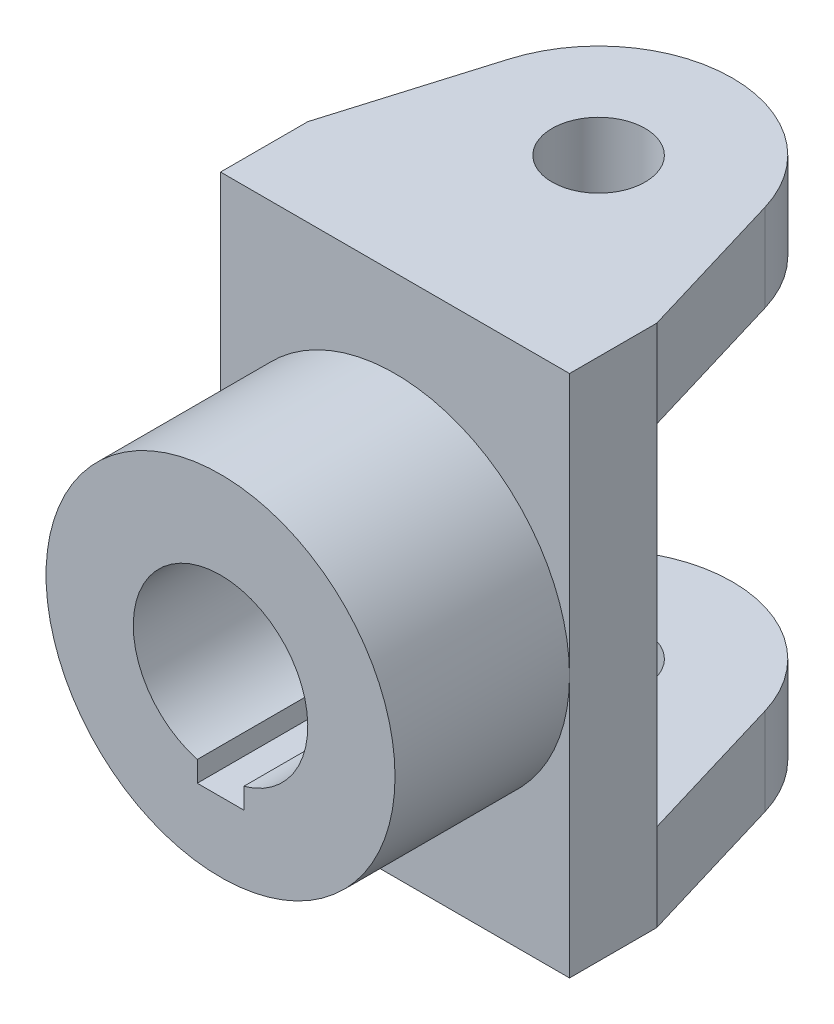
ISO-10303-21;
HEADER;
FILE_DESCRIPTION(('STEP AP214'),'2;1');
FILE_NAME('part.step','',(''),(''),'','','');
FILE_SCHEMA(('AUTOMOTIVE_DESIGN { 1 0 10303 214 1 1 1 1 }'));
ENDSEC;
DATA;
#1=APPLICATION_CONTEXT('core data for automotive mechanical design processes');
#2=APPLICATION_PROTOCOL_DEFINITION('international standard','automotive_design',2000,#1);
#3=PRODUCT_CONTEXT('',#1,'mechanical');
#4=PRODUCT('Part','Part','',(#3));
#5=PRODUCT_RELATED_PRODUCT_CATEGORY('part','',(#4));
#6=PRODUCT_DEFINITION_FORMATION('','',#4);
#7=PRODUCT_DEFINITION_CONTEXT('part definition',#1,'design');
#8=PRODUCT_DEFINITION('design','',#6,#7);
#9=PRODUCT_DEFINITION_SHAPE('','',#8);
#10=(LENGTH_UNIT() NAMED_UNIT(*) SI_UNIT(.MILLI.,.METRE.));
#11=(NAMED_UNIT(*) PLANE_ANGLE_UNIT() SI_UNIT($,.RADIAN.));
#12=(NAMED_UNIT(*) SI_UNIT($,.STERADIAN.) SOLID_ANGLE_UNIT());
#13=UNCERTAINTY_MEASURE_WITH_UNIT(LENGTH_MEASURE(1.E-05),#10,'distance_accuracy_value','');
#14=(GEOMETRIC_REPRESENTATION_CONTEXT(3) GLOBAL_UNCERTAINTY_ASSIGNED_CONTEXT((#13)) GLOBAL_UNIT_ASSIGNED_CONTEXT((#10,
#11,#12)) REPRESENTATION_CONTEXT('',''));
#15=CARTESIAN_POINT('',(0.,0.,0.));
#16=DIRECTION('',(0.,0.,1.));
#17=DIRECTION('',(1.,0.,0.));
#18=AXIS2_PLACEMENT_3D('',#15,#16,#17);
#19=CARTESIAN_POINT('',(0.,0.,-7.5));
#20=DIRECTION('',(0.,0.,1.));
#21=DIRECTION('',(1.,0.,0.));
#22=AXIS2_PLACEMENT_3D('',#19,#20,#21);
#23=PLANE('',#22);
#24=DIRECTION('',(-1.,0.,0.));
#25=VECTOR('',#24,1.);
#26=CARTESIAN_POINT('',(0.,-30.,-7.5));
#27=LINE('',#26,#25);
#28=CARTESIAN_POINT('',(30.,-30.,-7.5));
#29=VERTEX_POINT('',#28);
#30=CARTESIAN_POINT('',(-30.,-30.,-7.5));
#31=VERTEX_POINT('',#30);
#32=EDGE_CURVE('E162',#29,#31,#27,.T.);
#33=ORIENTED_EDGE('',*,*,#32,.T.);
#34=DIRECTION('',(0.,-1.,0.));
#35=VECTOR('',#34,1.);
#36=CARTESIAN_POINT('',(-30.,45.,-7.5));
#37=LINE('',#36,#35);
#38=CARTESIAN_POINT('',(-30.,30.,-7.5));
#39=VERTEX_POINT('',#38);
#40=EDGE_CURVE('E169',#39,#31,#37,.T.);
#41=ORIENTED_EDGE('',*,*,#40,.F.);
#42=DIRECTION('',(-1.,0.,0.));
#43=VECTOR('',#42,1.);
#44=CARTESIAN_POINT('',(0.,30.,-7.5));
#45=LINE('',#44,#43);
#46=CARTESIAN_POINT('',(30.,30.,-7.5));
#47=VERTEX_POINT('',#46);
#48=EDGE_CURVE('E227',#47,#39,#45,.T.);
#49=ORIENTED_EDGE('',*,*,#48,.F.);
#50=DIRECTION('',(0.,1.,0.));
#51=VECTOR('',#50,1.);
#52=CARTESIAN_POINT('',(30.,45.,-7.5));
#53=LINE('',#52,#51);
#54=EDGE_CURVE('E51',#29,#47,#53,.T.);
#55=ORIENTED_EDGE('',*,*,#54,.F.);
#56=EDGE_LOOP('',(#33,#41,#49,#55));
#57=FACE_BOUND('',#56,.T.);
#58=ADVANCED_FACE('F34',(#57),#23,.F.);
#59=CARTESIAN_POINT('',(0.,0.,7.5));
#60=DIRECTION('',(0.,0.,1.));
#61=DIRECTION('',(1.,0.,0.));
#62=AXIS2_PLACEMENT_3D('',#59,#60,#61);
#63=PLANE('',#62);
#64=CARTESIAN_POINT('',(0.,0.,7.5));
#65=DIRECTION('',(0.,0.,1.));
#66=DIRECTION('',(1.,0.,0.));
#67=AXIS2_PLACEMENT_3D('',#64,#65,#66);
#68=CIRCLE('',#67,30.);
#69=CARTESIAN_POINT('',(30.,0.,7.5));
#70=VERTEX_POINT('',#69);
#71=CARTESIAN_POINT('',(-30.,0.,7.5));
#72=VERTEX_POINT('',#71);
#73=EDGE_CURVE('E44',#70,#72,#68,.T.);
#74=ORIENTED_EDGE('',*,*,#73,.F.);
#75=DIRECTION('',(0.,1.,0.));
#76=VECTOR('',#75,1.);
#77=CARTESIAN_POINT('',(30.,45.,7.5));
#78=LINE('',#77,#76);
#79=CARTESIAN_POINT('',(30.,45.,7.5));
#80=VERTEX_POINT('',#79);
#81=EDGE_CURVE('E178',#70,#80,#78,.T.);
#82=ORIENTED_EDGE('',*,*,#81,.T.);
#83=DIRECTION('',(-1.,0.,0.));
#84=VECTOR('',#83,1.);
#85=CARTESIAN_POINT('',(-30.,45.,7.5));
#86=LINE('',#85,#84);
#87=CARTESIAN_POINT('',(-30.,45.,7.5));
#88=VERTEX_POINT('',#87);
#89=EDGE_CURVE('E201',#80,#88,#86,.T.);
#90=ORIENTED_EDGE('',*,*,#89,.T.);
#91=DIRECTION('',(0.,-1.,0.));
#92=VECTOR('',#91,1.);
#93=CARTESIAN_POINT('',(-30.,45.,7.5));
#94=LINE('',#93,#92);
#95=EDGE_CURVE('E270',#88,#72,#94,.T.);
#96=ORIENTED_EDGE('',*,*,#95,.T.);
#97=EDGE_LOOP('',(#74,#82,#90,#96));
#98=FACE_BOUND('',#97,.T.);
#99=ADVANCED_FACE('F286',(#98),#63,.T.);
#100=CARTESIAN_POINT('',(30.,45.,7.5));
#101=DIRECTION('',(-1.,0.,0.));
#102=DIRECTION('',(0.,-1.,0.));
#103=AXIS2_PLACEMENT_3D('',#100,#101,#102);
#104=PLANE('',#103);
#105=CARTESIAN_POINT('',(30.,-45.,-7.5));
#106=VERTEX_POINT('',#105);
#107=EDGE_CURVE('E176',#106,#29,#53,.T.);
#108=ORIENTED_EDGE('',*,*,#107,.T.);
#109=ORIENTED_EDGE('',*,*,#54,.T.);
#110=DIRECTION('',(0.,1.,0.));
#111=VECTOR('',#110,1.);
#112=CARTESIAN_POINT('',(30.,30.,-7.5));
#113=LINE('',#112,#111);
#114=CARTESIAN_POINT('',(30.,45.,-7.5));
#115=VERTEX_POINT('',#114);
#116=EDGE_CURVE('E207',#47,#115,#113,.T.);
#117=ORIENTED_EDGE('',*,*,#116,.T.);
#118=DIRECTION('',(0.,0.,-1.));
#119=VECTOR('',#118,1.);
#120=CARTESIAN_POINT('',(30.,45.,7.5));
#121=LINE('',#120,#119);
#122=EDGE_CURVE('E38',#80,#115,#121,.T.);
#123=ORIENTED_EDGE('',*,*,#122,.F.);
#124=ORIENTED_EDGE('',*,*,#81,.F.);
#125=CARTESIAN_POINT('',(30.,-45.,7.5));
#126=VERTEX_POINT('',#125);
#127=EDGE_CURVE('E266',#126,#70,#78,.T.);
#128=ORIENTED_EDGE('',*,*,#127,.F.);
#129=DIRECTION('',(0.,0.,-1.));
#130=VECTOR('',#129,1.);
#131=CARTESIAN_POINT('',(30.,-45.,7.5));
#132=LINE('',#131,#130);
#133=EDGE_CURVE('E182',#126,#106,#132,.T.);
#134=ORIENTED_EDGE('',*,*,#133,.T.);
#135=EDGE_LOOP('',(#108,#109,#117,#123,#124,#128,#134));
#136=FACE_BOUND('',#135,.T.);
#137=ADVANCED_FACE('F36',(#136),#104,.F.);
#138=CARTESIAN_POINT('',(-30.,45.,7.5));
#139=DIRECTION('',(0.,-1.,0.));
#140=DIRECTION('',(0.,0.,-1.));
#141=AXIS2_PLACEMENT_3D('',#138,#139,#140);
#142=PLANE('',#141);
#143=ORIENTED_EDGE('',*,*,#122,.T.);
#144=DIRECTION('',(-0.286928155856414,0.,-0.957952103905429));
#145=VECTOR('',#144,1.);
#146=CARTESIAN_POINT('',(29.5916427305978,45.,-8.86336116684442));
#147=LINE('',#146,#145);
#148=CARTESIAN_POINT('',(22.0328983898444,45.,-34.0993475846926));
#149=VERTEX_POINT('',#148);
#150=EDGE_CURVE('E200',#115,#149,#147,.T.);
#151=ORIENTED_EDGE('',*,*,#150,.T.);
#152=CARTESIAN_POINT('',(3.61065344289813E-11,45.,-27.5));
#153=DIRECTION('',(0.,1.,0.));
#154=DIRECTION('',(0.,0.,1.));
#155=AXIS2_PLACEMENT_3D('',#152,#153,#154);
#156=CIRCLE('',#155,22.9999999999655);
#157=CARTESIAN_POINT('',(-22.0328983897558,45.,-34.0993475847475));
#158=VERTEX_POINT('',#157);
#159=EDGE_CURVE('E211',#149,#158,#156,.T.);
#160=ORIENTED_EDGE('',*,*,#159,.T.);
#161=DIRECTION('',(0.2869281558588,0.,-0.957952103904714));
#162=VECTOR('',#161,1.);
#163=CARTESIAN_POINT('',(-29.5916427305723,45.,-8.86336116691711));
#164=LINE('',#163,#162);
#165=CARTESIAN_POINT('',(-30.,45.,-7.5));
#166=VERTEX_POINT('',#165);
#167=EDGE_CURVE('E214',#166,#158,#164,.T.);
#168=ORIENTED_EDGE('',*,*,#167,.F.);
#169=DIRECTION('',(0.,0.,-1.));
#170=VECTOR('',#169,1.);
#171=CARTESIAN_POINT('',(-30.,45.,7.5));
#172=LINE('',#171,#170);
#173=EDGE_CURVE('E187',#88,#166,#172,.T.);
#174=ORIENTED_EDGE('',*,*,#173,.F.);
#175=ORIENTED_EDGE('',*,*,#89,.F.);
#176=EDGE_LOOP('',(#143,#151,#160,#168,#174,#175));
#177=FACE_BOUND('',#176,.T.);
#178=CARTESIAN_POINT('',(3.61065344289813E-11,45.,-27.5));
#179=DIRECTION('',(0.,1.,0.));
#180=DIRECTION('',(0.,0.,1.));
#181=AXIS2_PLACEMENT_3D('',#178,#179,#180);
#182=CIRCLE('',#181,7.99999999996547);
#183=CARTESIAN_POINT('',(3.61065344289813E-11,45.,-19.5000000000345));
#184=VERTEX_POINT('',#183);
#185=EDGE_CURVE('E224',#184,#184,#182,.T.);
#186=ORIENTED_EDGE('',*,*,#185,.F.);
#187=EDGE_LOOP('',(#186));
#188=FACE_BOUND('',#187,.T.);
#189=ADVANCED_FACE('F197',(#177,#188),#142,.F.);
#190=CARTESIAN_POINT('',(-30.,45.,7.5));
#191=DIRECTION('',(1.,0.,0.));
#192=DIRECTION('',(0.,1.,0.));
#193=AXIS2_PLACEMENT_3D('',#190,#191,#192);
#194=PLANE('',#193);
#195=EDGE_CURVE('E175',#166,#39,#37,.T.);
#196=ORIENTED_EDGE('',*,*,#195,.T.);
#197=ORIENTED_EDGE('',*,*,#40,.T.);
#198=DIRECTION('',(0.,-1.,0.));
#199=VECTOR('',#198,1.);
#200=CARTESIAN_POINT('',(-30.,-30.,-7.5));
#201=LINE('',#200,#199);
#202=CARTESIAN_POINT('',(-30.,-45.,-7.5));
#203=VERTEX_POINT('',#202);
#204=EDGE_CURVE('E144',#31,#203,#201,.T.);
#205=ORIENTED_EDGE('',*,*,#204,.T.);
#206=DIRECTION('',(0.,0.,-1.));
#207=VECTOR('',#206,1.);
#208=CARTESIAN_POINT('',(-30.,-45.,7.5));
#209=LINE('',#208,#207);
#210=CARTESIAN_POINT('',(-30.,-45.,7.5));
#211=VERTEX_POINT('',#210);
#212=EDGE_CURVE('E185',#211,#203,#209,.T.);
#213=ORIENTED_EDGE('',*,*,#212,.F.);
#214=EDGE_CURVE('E269',#72,#211,#94,.T.);
#215=ORIENTED_EDGE('',*,*,#214,.F.);
#216=ORIENTED_EDGE('',*,*,#95,.F.);
#217=ORIENTED_EDGE('',*,*,#173,.T.);
#218=EDGE_LOOP('',(#196,#197,#205,#213,#215,#216,#217));
#219=FACE_BOUND('',#218,.T.);
#220=ADVANCED_FACE('F173',(#219),#194,.F.);
#221=CARTESIAN_POINT('',(-30.,-45.,7.5));
#222=DIRECTION('',(0.,1.,0.));
#223=DIRECTION('',(0.,0.,1.));
#224=AXIS2_PLACEMENT_3D('',#221,#222,#223);
#225=PLANE('',#224);
#226=ORIENTED_EDGE('',*,*,#212,.T.);
#227=DIRECTION('',(0.2869281558588,0.,-0.957952103904714));
#228=VECTOR('',#227,1.);
#229=CARTESIAN_POINT('',(-29.5916427305723,-45.,-8.86336116691711));
#230=LINE('',#229,#228);
#231=CARTESIAN_POINT('',(-22.0328983897558,-45.,-34.0993475847475));
#232=VERTEX_POINT('',#231);
#233=EDGE_CURVE('E149',#203,#232,#230,.T.);
#234=ORIENTED_EDGE('',*,*,#233,.T.);
#235=CARTESIAN_POINT('',(3.61065344289813E-11,-45.,-27.5));
#236=DIRECTION('',(0.,1.,0.));
#237=DIRECTION('',(0.,0.,1.));
#238=AXIS2_PLACEMENT_3D('',#235,#236,#237);
#239=CIRCLE('',#238,22.9999999999655);
#240=CARTESIAN_POINT('',(22.0328983898444,-45.,-34.0993475846926));
#241=VERTEX_POINT('',#240);
#242=EDGE_CURVE('E290',#241,#232,#239,.T.);
#243=ORIENTED_EDGE('',*,*,#242,.F.);
#244=DIRECTION('',(-0.286928155856414,0.,-0.957952103905429));
#245=VECTOR('',#244,1.);
#246=CARTESIAN_POINT('',(29.5916427305978,-45.,-8.86336116684442));
#247=LINE('',#246,#245);
#248=EDGE_CURVE('E282',#106,#241,#247,.T.);
#249=ORIENTED_EDGE('',*,*,#248,.F.);
#250=ORIENTED_EDGE('',*,*,#133,.F.);
#251=DIRECTION('',(1.,0.,0.));
#252=VECTOR('',#251,1.);
#253=CARTESIAN_POINT('',(-30.,-45.,7.5));
#254=LINE('',#253,#252);
#255=EDGE_CURVE('E186',#211,#126,#254,.T.);
#256=ORIENTED_EDGE('',*,*,#255,.F.);
#257=EDGE_LOOP('',(#226,#234,#243,#249,#250,#256));
#258=FACE_BOUND('',#257,.T.);
#259=CARTESIAN_POINT('',(3.61065344289813E-11,-45.,-27.5));
#260=DIRECTION('',(0.,1.,0.));
#261=DIRECTION('',(0.,0.,1.));
#262=AXIS2_PLACEMENT_3D('',#259,#260,#261);
#263=CIRCLE('',#262,7.99999999996547);
#264=CARTESIAN_POINT('',(3.61065344289813E-11,-45.,-19.5000000000345));
#265=VERTEX_POINT('',#264);
#266=EDGE_CURVE('E171',#265,#265,#263,.T.);
#267=ORIENTED_EDGE('',*,*,#266,.T.);
#268=EDGE_LOOP('',(#267));
#269=FACE_BOUND('',#268,.T.);
#270=ADVANCED_FACE('F279',(#258,#269),#225,.F.);
#271=EDGE_CURVE('E11',#72,#70,#68,.T.);
#272=ORIENTED_EDGE('',*,*,#271,.F.);
#273=ORIENTED_EDGE('',*,*,#214,.T.);
#274=ORIENTED_EDGE('',*,*,#255,.T.);
#275=ORIENTED_EDGE('',*,*,#127,.T.);
#276=EDGE_LOOP('',(#272,#273,#274,#275));
#277=FACE_BOUND('',#276,.T.);
#278=ADVANCED_FACE('F275',(#277),#63,.T.);
#279=CARTESIAN_POINT('',(0.,0.,37.5));
#280=DIRECTION('',(0.,0.,-1.));
#281=DIRECTION('',(-1.,0.,0.));
#282=AXIS2_PLACEMENT_3D('',#279,#280,#281);
#283=CYLINDRICAL_SURFACE('',#282,15.);
#284=CARTESIAN_POINT('',(0.,0.,7.5));
#285=DIRECTION('',(0.,0.,1.));
#286=DIRECTION('',(1.,0.,0.));
#287=AXIS2_PLACEMENT_3D('',#284,#285,#286);
#288=CIRCLE('',#287,15.);
#289=CARTESIAN_POINT('',(4.,-14.456832294801,7.5));
#290=VERTEX_POINT('',#289);
#291=CARTESIAN_POINT('',(-4.,-14.456832294801,7.5));
#292=VERTEX_POINT('',#291);
#293=EDGE_CURVE('E59',#290,#292,#288,.T.);
#294=ORIENTED_EDGE('',*,*,#293,.F.);
#295=DIRECTION('',(0.,0.,-1.));
#296=VECTOR('',#295,1.);
#297=CARTESIAN_POINT('',(4.,-14.456832294801,37.5));
#298=LINE('',#297,#296);
#299=CARTESIAN_POINT('',(4.,-14.456832294801,37.5));
#300=VERTEX_POINT('',#299);
#301=EDGE_CURVE('E263',#300,#290,#298,.T.);
#302=ORIENTED_EDGE('',*,*,#301,.F.);
#303=CARTESIAN_POINT('',(0.,0.,37.5));
#304=DIRECTION('',(0.,0.,1.));
#305=DIRECTION('',(1.,0.,0.));
#306=AXIS2_PLACEMENT_3D('',#303,#304,#305);
#307=CIRCLE('',#306,15.);
#308=CARTESIAN_POINT('',(-4.,-14.456832294801,37.5));
#309=VERTEX_POINT('',#308);
#310=EDGE_CURVE('E232',#300,#309,#307,.T.);
#311=ORIENTED_EDGE('',*,*,#310,.T.);
#312=DIRECTION('',(0.,0.,-1.));
#313=VECTOR('',#312,1.);
#314=CARTESIAN_POINT('',(-4.,-14.456832294801,37.5));
#315=LINE('',#314,#313);
#316=EDGE_CURVE('E246',#309,#292,#315,.T.);
#317=ORIENTED_EDGE('',*,*,#316,.T.);
#318=EDGE_LOOP('',(#294,#302,#311,#317));
#319=FACE_BOUND('',#318,.T.);
#320=ADVANCED_FACE('F339',(#319),#283,.F.);
#321=CARTESIAN_POINT('',(4.,0.,37.5));
#322=DIRECTION('',(1.,0.,0.));
#323=DIRECTION('',(0.,0.,-1.));
#324=AXIS2_PLACEMENT_3D('',#321,#322,#323);
#325=PLANE('',#324);
#326=DIRECTION('',(0.,-1.,0.));
#327=VECTOR('',#326,1.);
#328=CARTESIAN_POINT('',(4.,0.,7.5));
#329=LINE('',#328,#327);
#330=CARTESIAN_POINT('',(4.,-18.,7.5));
#331=VERTEX_POINT('',#330);
#332=EDGE_CURVE('E248',#290,#331,#329,.T.);
#333=ORIENTED_EDGE('',*,*,#332,.T.);
#334=DIRECTION('',(0.,0.,-1.));
#335=VECTOR('',#334,1.);
#336=CARTESIAN_POINT('',(4.,-18.,37.5));
#337=LINE('',#336,#335);
#338=CARTESIAN_POINT('',(4.,-18.,37.5));
#339=VERTEX_POINT('',#338);
#340=EDGE_CURVE('E260',#339,#331,#337,.T.);
#341=ORIENTED_EDGE('',*,*,#340,.F.);
#342=DIRECTION('',(0.,-1.,0.));
#343=VECTOR('',#342,1.);
#344=CARTESIAN_POINT('',(4.,0.,37.5));
#345=LINE('',#344,#343);
#346=EDGE_CURVE('E235',#300,#339,#345,.T.);
#347=ORIENTED_EDGE('',*,*,#346,.F.);
#348=ORIENTED_EDGE('',*,*,#301,.T.);
#349=EDGE_LOOP('',(#333,#341,#347,#348));
#350=FACE_BOUND('',#349,.T.);
#351=ADVANCED_FACE('F343',(#350),#325,.F.);
#352=CARTESIAN_POINT('',(0.,-18.,37.5));
#353=DIRECTION('',(0.,1.,0.));
#354=DIRECTION('',(0.,0.,1.));
#355=AXIS2_PLACEMENT_3D('',#352,#353,#354);
#356=PLANE('',#355);
#357=DIRECTION('',(1.,0.,0.));
#358=VECTOR('',#357,1.);
#359=CARTESIAN_POINT('',(0.,-18.,7.5));
#360=LINE('',#359,#358);
#361=CARTESIAN_POINT('',(-4.,-18.,7.5));
#362=VERTEX_POINT('',#361);
#363=EDGE_CURVE('E251',#362,#331,#360,.T.);
#364=ORIENTED_EDGE('',*,*,#363,.F.);
#365=DIRECTION('',(0.,0.,-1.));
#366=VECTOR('',#365,1.);
#367=CARTESIAN_POINT('',(-4.,-18.,37.5));
#368=LINE('',#367,#366);
#369=CARTESIAN_POINT('',(-4.,-18.,37.5));
#370=VERTEX_POINT('',#369);
#371=EDGE_CURVE('E257',#370,#362,#368,.T.);
#372=ORIENTED_EDGE('',*,*,#371,.F.);
#373=DIRECTION('',(1.,0.,0.));
#374=VECTOR('',#373,1.);
#375=CARTESIAN_POINT('',(0.,-18.,37.5));
#376=LINE('',#375,#374);
#377=EDGE_CURVE('E237',#370,#339,#376,.T.);
#378=ORIENTED_EDGE('',*,*,#377,.T.);
#379=ORIENTED_EDGE('',*,*,#340,.T.);
#380=EDGE_LOOP('',(#364,#372,#378,#379));
#381=FACE_BOUND('',#380,.T.);
#382=ADVANCED_FACE('F368',(#381),#356,.T.);
#383=CARTESIAN_POINT('',(-4.,0.,37.5));
#384=DIRECTION('',(1.,0.,0.));
#385=DIRECTION('',(0.,0.,-1.));
#386=AXIS2_PLACEMENT_3D('',#383,#384,#385);
#387=PLANE('',#386);
#388=DIRECTION('',(0.,-1.,0.));
#389=VECTOR('',#388,1.);
#390=CARTESIAN_POINT('',(-4.,0.,7.5));
#391=LINE('',#390,#389);
#392=EDGE_CURVE('E253',#292,#362,#391,.T.);
#393=ORIENTED_EDGE('',*,*,#392,.F.);
#394=ORIENTED_EDGE('',*,*,#316,.F.);
#395=DIRECTION('',(0.,-1.,0.));
#396=VECTOR('',#395,1.);
#397=CARTESIAN_POINT('',(-4.,0.,37.5));
#398=LINE('',#397,#396);
#399=EDGE_CURVE('E240',#309,#370,#398,.T.);
#400=ORIENTED_EDGE('',*,*,#399,.T.);
#401=ORIENTED_EDGE('',*,*,#371,.T.);
#402=EDGE_LOOP('',(#393,#394,#400,#401));
#403=FACE_BOUND('',#402,.T.);
#404=ADVANCED_FACE('F365',(#403),#387,.T.);
#405=CARTESIAN_POINT('',(0.,0.,37.5));
#406=DIRECTION('',(0.,0.,-1.));
#407=DIRECTION('',(-1.,0.,0.));
#408=AXIS2_PLACEMENT_3D('',#405,#406,#407);
#409=CYLINDRICAL_SURFACE('',#408,30.);
#410=CARTESIAN_POINT('',(0.,0.,37.5));
#411=DIRECTION('',(0.,0.,1.));
#412=DIRECTION('',(1.,0.,0.));
#413=AXIS2_PLACEMENT_3D('',#410,#411,#412);
#414=CIRCLE('',#413,30.);
#415=CARTESIAN_POINT('',(30.,0.,37.5));
#416=VERTEX_POINT('',#415);
#417=EDGE_CURVE('E243',#416,#416,#414,.T.);
#418=ORIENTED_EDGE('',*,*,#417,.F.);
#419=EDGE_LOOP('',(#418));
#420=FACE_BOUND('',#419,.T.);
#421=ORIENTED_EDGE('',*,*,#73,.T.);
#422=ORIENTED_EDGE('',*,*,#271,.T.);
#423=EDGE_LOOP('',(#421,#422));
#424=FACE_BOUND('',#423,.T.);
#425=ADVANCED_FACE('F288',(#420,#424),#409,.T.);
#426=CARTESIAN_POINT('',(0.,0.,37.5));
#427=DIRECTION('',(0.,0.,1.));
#428=DIRECTION('',(1.,0.,0.));
#429=AXIS2_PLACEMENT_3D('',#426,#427,#428);
#430=PLANE('',#429);
#431=ORIENTED_EDGE('',*,*,#310,.F.);
#432=ORIENTED_EDGE('',*,*,#346,.T.);
#433=ORIENTED_EDGE('',*,*,#377,.F.);
#434=ORIENTED_EDGE('',*,*,#399,.F.);
#435=EDGE_LOOP('',(#431,#432,#433,#434));
#436=FACE_BOUND('',#435,.T.);
#437=ORIENTED_EDGE('',*,*,#417,.T.);
#438=EDGE_LOOP('',(#437));
#439=FACE_BOUND('',#438,.T.);
#440=ADVANCED_FACE('F347',(#436,#439),#430,.T.);
#441=ORIENTED_EDGE('',*,*,#332,.F.);
#442=ORIENTED_EDGE('',*,*,#293,.T.);
#443=ORIENTED_EDGE('',*,*,#392,.T.);
#444=ORIENTED_EDGE('',*,*,#363,.T.);
#445=EDGE_LOOP('',(#441,#442,#443,#444));
#446=FACE_BOUND('',#445,.T.);
#447=ADVANCED_FACE('F332',(#446),#63,.T.);
#448=CARTESIAN_POINT('',(-29.5916427305723,30.,-8.86336116691711));
#449=DIRECTION('',(0.957952103904714,0.,0.2869281558588));
#450=DIRECTION('',(0.2869281558588,0.,-0.957952103904714));
#451=AXIS2_PLACEMENT_3D('',#448,#449,#450);
#452=PLANE('',#451);
#453=ORIENTED_EDGE('',*,*,#167,.T.);
#454=DIRECTION('',(0.,1.,0.));
#455=VECTOR('',#454,1.);
#456=CARTESIAN_POINT('',(-22.0328983897558,30.,-34.0993475847475));
#457=LINE('',#456,#455);
#458=CARTESIAN_POINT('',(-22.0328983897558,30.,-34.0993475847475));
#459=VERTEX_POINT('',#458);
#460=EDGE_CURVE('E228',#459,#158,#457,.T.);
#461=ORIENTED_EDGE('',*,*,#460,.F.);
#462=DIRECTION('',(0.2869281558588,0.,-0.957952103904714));
#463=VECTOR('',#462,1.);
#464=CARTESIAN_POINT('',(-29.5916427305723,30.,-8.86336116691711));
#465=LINE('',#464,#463);
#466=EDGE_CURVE('E306',#39,#459,#465,.T.);
#467=ORIENTED_EDGE('',*,*,#466,.F.);
#468=ORIENTED_EDGE('',*,*,#195,.F.);
#469=EDGE_LOOP('',(#453,#461,#467,#468));
#470=FACE_BOUND('',#469,.T.);
#471=ADVANCED_FACE('F346',(#470),#452,.F.);
#472=CARTESIAN_POINT('',(3.61065344289813E-11,30.,-27.5));
#473=DIRECTION('',(0.,1.,0.));
#474=DIRECTION('',(0.,0.,1.));
#475=AXIS2_PLACEMENT_3D('',#472,#473,#474);
#476=CYLINDRICAL_SURFACE('',#475,22.9999999999655);
#477=ORIENTED_EDGE('',*,*,#159,.F.);
#478=DIRECTION('',(0.,1.,0.));
#479=VECTOR('',#478,1.);
#480=CARTESIAN_POINT('',(22.0328983898444,30.,-34.0993475846926));
#481=LINE('',#480,#479);
#482=CARTESIAN_POINT('',(22.0328983898444,30.,-34.0993475846926));
#483=VERTEX_POINT('',#482);
#484=EDGE_CURVE('E209',#483,#149,#481,.T.);
#485=ORIENTED_EDGE('',*,*,#484,.F.);
#486=CARTESIAN_POINT('',(3.61065344289813E-11,30.,-27.5));
#487=DIRECTION('',(0.,1.,0.));
#488=DIRECTION('',(0.,0.,1.));
#489=AXIS2_PLACEMENT_3D('',#486,#487,#488);
#490=CIRCLE('',#489,22.9999999999655);
#491=EDGE_CURVE('E304',#483,#459,#490,.T.);
#492=ORIENTED_EDGE('',*,*,#491,.T.);
#493=ORIENTED_EDGE('',*,*,#460,.T.);
#494=EDGE_LOOP('',(#477,#485,#492,#493));
#495=FACE_BOUND('',#494,.T.);
#496=ADVANCED_FACE('F352',(#495),#476,.T.);
#497=CARTESIAN_POINT('',(29.5916427305978,30.,-8.86336116684442));
#498=DIRECTION('',(0.957952103905429,0.,-0.286928155856414));
#499=DIRECTION('',(-0.286928155856414,0.,-0.957952103905429));
#500=AXIS2_PLACEMENT_3D('',#497,#498,#499);
#501=PLANE('',#500);
#502=ORIENTED_EDGE('',*,*,#150,.F.);
#503=ORIENTED_EDGE('',*,*,#116,.F.);
#504=DIRECTION('',(-0.286928155856414,0.,-0.957952103905429));
#505=VECTOR('',#504,1.);
#506=CARTESIAN_POINT('',(29.5916427305978,30.,-8.86336116684442));
#507=LINE('',#506,#505);
#508=EDGE_CURVE('E302',#47,#483,#507,.T.);
#509=ORIENTED_EDGE('',*,*,#508,.T.);
#510=ORIENTED_EDGE('',*,*,#484,.T.);
#511=EDGE_LOOP('',(#502,#503,#509,#510));
#512=FACE_BOUND('',#511,.T.);
#513=ADVANCED_FACE('F205',(#512),#501,.T.);
#514=CARTESIAN_POINT('',(3.61065344289813E-11,30.,-27.5));
#515=DIRECTION('',(0.,1.,0.));
#516=DIRECTION('',(0.,0.,1.));
#517=AXIS2_PLACEMENT_3D('',#514,#515,#516);
#518=CYLINDRICAL_SURFACE('',#517,7.99999999996547);
#519=CARTESIAN_POINT('',(3.61065344289813E-11,30.,-27.5));
#520=DIRECTION('',(0.,1.,0.));
#521=DIRECTION('',(0.,0.,1.));
#522=AXIS2_PLACEMENT_3D('',#519,#520,#521);
#523=CIRCLE('',#522,7.99999999996547);
#524=CARTESIAN_POINT('',(3.61065344289813E-11,30.,-19.5000000000345));
#525=VERTEX_POINT('',#524);
#526=EDGE_CURVE('E219',#525,#525,#523,.T.);
#527=ORIENTED_EDGE('',*,*,#526,.F.);
#528=EDGE_LOOP('',(#527));
#529=FACE_BOUND('',#528,.T.);
#530=ORIENTED_EDGE('',*,*,#185,.T.);
#531=EDGE_LOOP('',(#530));
#532=FACE_BOUND('',#531,.T.);
#533=ADVANCED_FACE('F315',(#529,#532),#518,.F.);
#534=CARTESIAN_POINT('',(0.,30.,0.));
#535=DIRECTION('',(0.,1.,0.));
#536=DIRECTION('',(0.,0.,1.));
#537=AXIS2_PLACEMENT_3D('',#534,#535,#536);
#538=PLANE('',#537);
#539=ORIENTED_EDGE('',*,*,#48,.T.);
#540=ORIENTED_EDGE('',*,*,#466,.T.);
#541=ORIENTED_EDGE('',*,*,#491,.F.);
#542=ORIENTED_EDGE('',*,*,#508,.F.);
#543=EDGE_LOOP('',(#539,#540,#541,#542));
#544=FACE_BOUND('',#543,.T.);
#545=ORIENTED_EDGE('',*,*,#526,.T.);
#546=EDGE_LOOP('',(#545));
#547=FACE_BOUND('',#546,.T.);
#548=ADVANCED_FACE('F313',(#544,#547),#538,.F.);
#549=CARTESIAN_POINT('',(29.5916427305978,-30.,-8.86336116684442));
#550=DIRECTION('',(-0.957952103905429,0.,0.286928155856414));
#551=DIRECTION('',(0.286928155856414,0.,0.957952103905429));
#552=AXIS2_PLACEMENT_3D('',#549,#550,#551);
#553=PLANE('',#552);
#554=ORIENTED_EDGE('',*,*,#248,.T.);
#555=DIRECTION('',(0.,-1.,0.));
#556=VECTOR('',#555,1.);
#557=CARTESIAN_POINT('',(22.0328983898444,-30.,-34.0993475846926));
#558=LINE('',#557,#556);
#559=CARTESIAN_POINT('',(22.0328983898444,-30.,-34.0993475846926));
#560=VERTEX_POINT('',#559);
#561=EDGE_CURVE('E212',#560,#241,#558,.T.);
#562=ORIENTED_EDGE('',*,*,#561,.F.);
#563=DIRECTION('',(-0.286928155856414,0.,-0.957952103905429));
#564=VECTOR('',#563,1.);
#565=CARTESIAN_POINT('',(29.5916427305978,-30.,-8.86336116684442));
#566=LINE('',#565,#564);
#567=EDGE_CURVE('E539',#29,#560,#566,.T.);
#568=ORIENTED_EDGE('',*,*,#567,.F.);
#569=ORIENTED_EDGE('',*,*,#107,.F.);
#570=EDGE_LOOP('',(#554,#562,#568,#569));
#571=FACE_BOUND('',#570,.T.);
#572=ADVANCED_FACE('F454',(#571),#553,.F.);
#573=CARTESIAN_POINT('',(3.61065344289813E-11,-30.,-27.5));
#574=DIRECTION('',(0.,-1.,0.));
#575=DIRECTION('',(0.,0.,-1.));
#576=AXIS2_PLACEMENT_3D('',#573,#574,#575);
#577=CYLINDRICAL_SURFACE('',#576,22.9999999999655);
#578=ORIENTED_EDGE('',*,*,#242,.T.);
#579=DIRECTION('',(0.,-1.,0.));
#580=VECTOR('',#579,1.);
#581=CARTESIAN_POINT('',(-22.0328983897558,-30.,-34.0993475847475));
#582=LINE('',#581,#580);
#583=CARTESIAN_POINT('',(-22.0328983897558,-30.,-34.0993475847475));
#584=VERTEX_POINT('',#583);
#585=EDGE_CURVE('E154',#584,#232,#582,.T.);
#586=ORIENTED_EDGE('',*,*,#585,.F.);
#587=CARTESIAN_POINT('',(3.61065344289813E-11,-30.,-27.5));
#588=DIRECTION('',(0.,1.,0.));
#589=DIRECTION('',(0.,0.,1.));
#590=AXIS2_PLACEMENT_3D('',#587,#588,#589);
#591=CIRCLE('',#590,22.9999999999655);
#592=EDGE_CURVE('E164',#560,#584,#591,.T.);
#593=ORIENTED_EDGE('',*,*,#592,.F.);
#594=ORIENTED_EDGE('',*,*,#561,.T.);
#595=EDGE_LOOP('',(#578,#586,#593,#594));
#596=FACE_BOUND('',#595,.T.);
#597=ADVANCED_FACE('F489',(#596),#577,.T.);
#598=CARTESIAN_POINT('',(-29.5916427305723,-30.,-8.86336116691711));
#599=DIRECTION('',(-0.957952103904714,0.,-0.2869281558588));
#600=DIRECTION('',(-0.2869281558588,0.,0.957952103904714));
#601=AXIS2_PLACEMENT_3D('',#598,#599,#600);
#602=PLANE('',#601);
#603=ORIENTED_EDGE('',*,*,#233,.F.);
#604=ORIENTED_EDGE('',*,*,#204,.F.);
#605=DIRECTION('',(0.2869281558588,0.,-0.957952103904714));
#606=VECTOR('',#605,1.);
#607=CARTESIAN_POINT('',(-29.5916427305723,-30.,-8.86336116691711));
#608=LINE('',#607,#606);
#609=EDGE_CURVE('E147',#31,#584,#608,.T.);
#610=ORIENTED_EDGE('',*,*,#609,.T.);
#611=ORIENTED_EDGE('',*,*,#585,.T.);
#612=EDGE_LOOP('',(#603,#604,#610,#611));
#613=FACE_BOUND('',#612,.T.);
#614=ADVANCED_FACE('F146',(#613),#602,.T.);
#615=CARTESIAN_POINT('',(3.61065344289813E-11,-30.,-27.5));
#616=DIRECTION('',(0.,-1.,0.));
#617=DIRECTION('',(0.,0.,-1.));
#618=AXIS2_PLACEMENT_3D('',#615,#616,#617);
#619=CYLINDRICAL_SURFACE('',#618,7.99999999996547);
#620=CARTESIAN_POINT('',(3.61065344289813E-11,-30.,-27.5));
#621=DIRECTION('',(0.,1.,0.));
#622=DIRECTION('',(0.,0.,1.));
#623=AXIS2_PLACEMENT_3D('',#620,#621,#622);
#624=CIRCLE('',#623,7.99999999996547);
#625=CARTESIAN_POINT('',(3.61065344289813E-11,-30.,-19.5000000000345));
#626=VERTEX_POINT('',#625);
#627=EDGE_CURVE('E155',#626,#626,#624,.T.);
#628=ORIENTED_EDGE('',*,*,#627,.T.);
#629=EDGE_LOOP('',(#628));
#630=FACE_BOUND('',#629,.T.);
#631=ORIENTED_EDGE('',*,*,#266,.F.);
#632=EDGE_LOOP('',(#631));
#633=FACE_BOUND('',#632,.T.);
#634=ADVANCED_FACE('F508',(#630,#633),#619,.F.);
#635=CARTESIAN_POINT('',(0.,-30.,0.));
#636=DIRECTION('',(0.,-1.,0.));
#637=DIRECTION('',(0.,0.,1.));
#638=AXIS2_PLACEMENT_3D('',#635,#636,#637);
#639=PLANE('',#638);
#640=ORIENTED_EDGE('',*,*,#32,.F.);
#641=ORIENTED_EDGE('',*,*,#567,.T.);
#642=ORIENTED_EDGE('',*,*,#592,.T.);
#643=ORIENTED_EDGE('',*,*,#609,.F.);
#644=EDGE_LOOP('',(#640,#641,#642,#643));
#645=FACE_BOUND('',#644,.T.);
#646=ORIENTED_EDGE('',*,*,#627,.F.);
#647=EDGE_LOOP('',(#646));
#648=FACE_BOUND('',#647,.T.);
#649=ADVANCED_FACE('F160',(#645,#648),#639,.F.);
#650=CLOSED_SHELL('',(#58,#99,#137,#189,#220,#270,#278,#320,#351,#382,#404,#425,#440,#447,#471,
#496,#513,#533,#548,#572,#597,#614,#634,#649));
#651=MANIFOLD_SOLID_BREP('B2',#650);
#652=ADVANCED_BREP_SHAPE_REPRESENTATION('',(#18,#651),#14);
#653=SHAPE_DEFINITION_REPRESENTATION(#9,#652);
ENDSEC;
END-ISO-10303-21;
